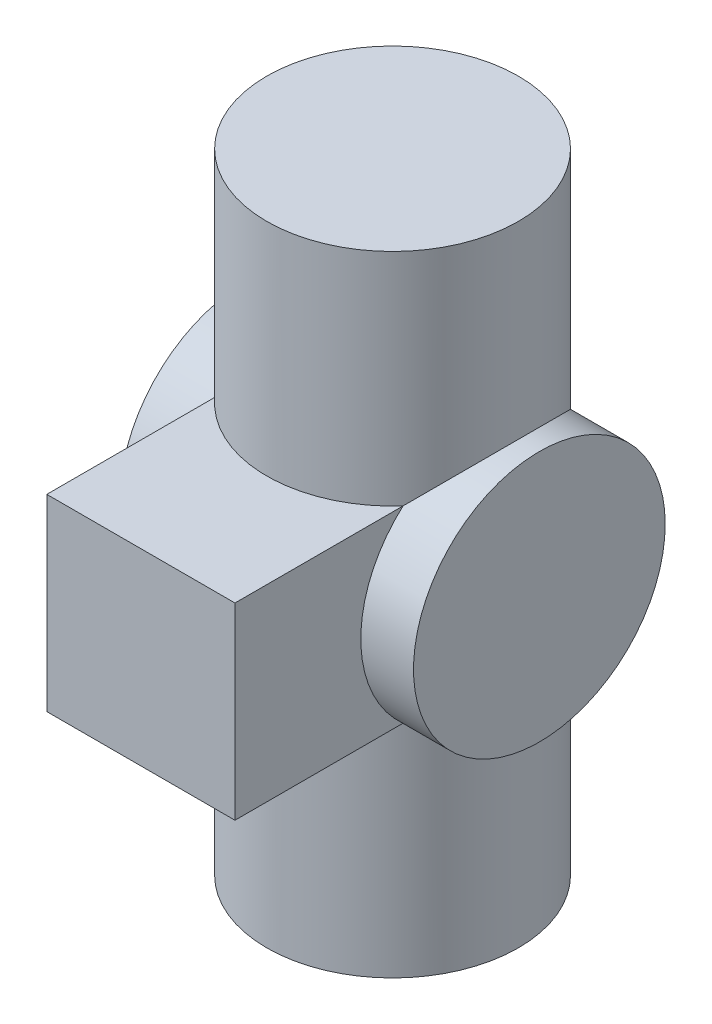
ISO-10303-21;
HEADER;
FILE_DESCRIPTION(('STEP AP214'),'2;1');
FILE_NAME('part.step','',(''),(''),'','','');
FILE_SCHEMA(('AUTOMOTIVE_DESIGN { 1 0 10303 214 1 1 1 1 }'));
ENDSEC;
DATA;
#1=APPLICATION_CONTEXT('core data for automotive mechanical design processes');
#2=APPLICATION_PROTOCOL_DEFINITION('international standard','automotive_design',2000,#1);
#3=PRODUCT_CONTEXT('',#1,'mechanical');
#4=PRODUCT('Part','Part','',(#3));
#5=PRODUCT_RELATED_PRODUCT_CATEGORY('part','',(#4));
#6=PRODUCT_DEFINITION_FORMATION('','',#4);
#7=PRODUCT_DEFINITION_CONTEXT('part definition',#1,'design');
#8=PRODUCT_DEFINITION('design','',#6,#7);
#9=PRODUCT_DEFINITION_SHAPE('','',#8);
#10=(LENGTH_UNIT() NAMED_UNIT(*) SI_UNIT(.MILLI.,.METRE.));
#11=(NAMED_UNIT(*) PLANE_ANGLE_UNIT() SI_UNIT($,.RADIAN.));
#12=(NAMED_UNIT(*) SI_UNIT($,.STERADIAN.) SOLID_ANGLE_UNIT());
#13=UNCERTAINTY_MEASURE_WITH_UNIT(LENGTH_MEASURE(1.E-05),#10,'distance_accuracy_value','');
#14=(GEOMETRIC_REPRESENTATION_CONTEXT(3) GLOBAL_UNCERTAINTY_ASSIGNED_CONTEXT((#13)) GLOBAL_UNIT_ASSIGNED_CONTEXT((#10,
#11,#12)) REPRESENTATION_CONTEXT('',''));
#15=CARTESIAN_POINT('',(0.,0.,0.));
#16=DIRECTION('',(0.,0.,1.));
#17=DIRECTION('',(1.,0.,0.));
#18=AXIS2_PLACEMENT_3D('',#15,#16,#17);
#19=CARTESIAN_POINT('',(0.,150.,0.));
#20=DIRECTION('',(0.,-1.,0.));
#21=DIRECTION('',(0.,0.,-1.));
#22=AXIS2_PLACEMENT_3D('',#19,#20,#21);
#23=CYLINDRICAL_SURFACE('',#22,30.);
#24=CARTESIAN_POINT('',(0.,150.,0.));
#25=DIRECTION('',(0.,1.,0.));
#26=DIRECTION('',(0.,0.,1.));
#27=AXIS2_PLACEMENT_3D('',#24,#25,#26);
#28=CIRCLE('',#27,30.);
#29=CARTESIAN_POINT('',(0.,150.,30.));
#30=VERTEX_POINT('',#29);
#31=EDGE_CURVE('E133',#30,#30,#28,.T.);
#32=ORIENTED_EDGE('',*,*,#31,.F.);
#33=EDGE_LOOP('',(#32));
#34=FACE_BOUND('',#33,.T.);
#35=CARTESIAN_POINT('',(0.,97.4302135046957,0.));
#36=DIRECTION('',(0.,-1.,0.));
#37=DIRECTION('',(0.,0.,-1.));
#38=AXIS2_PLACEMENT_3D('',#35,#36,#37);
#39=CIRCLE('',#38,30.);
#40=CARTESIAN_POINT('',(22.4302135046957,97.4302135046957,19.9219858983427));
#41=VERTEX_POINT('',#40);
#42=CARTESIAN_POINT('',(-22.4302135046957,97.4302135046957,19.9219858983427));
#43=VERTEX_POINT('',#42);
#44=EDGE_CURVE('E110',#41,#43,#39,.T.);
#45=ORIENTED_EDGE('',*,*,#44,.F.);
#46=CARTESIAN_POINT('',(0.,75.,0.));
#47=DIRECTION('',(0.707106781186547,-0.707106781186547,0.));
#48=DIRECTION('',(-0.707106781186547,-0.707106781186547,0.));
#49=AXIS2_PLACEMENT_3D('',#46,#47,#48);
#50=ELLIPSE('',#49,42.4264068711928,30.);
#51=CARTESIAN_POINT('',(0.,75.,-30.));
#52=VERTEX_POINT('',#51);
#53=EDGE_CURVE('E143',#52,#41,#50,.T.);
#54=ORIENTED_EDGE('',*,*,#53,.F.);
#55=CARTESIAN_POINT('',(0.,75.,0.));
#56=DIRECTION('',(-0.707106781186547,-0.707106781186547,0.));
#57=DIRECTION('',(0.707106781186547,-0.707106781186547,0.));
#58=AXIS2_PLACEMENT_3D('',#55,#56,#57);
#59=ELLIPSE('',#58,42.4264068711928,30.);
#60=EDGE_CURVE('E146',#43,#52,#59,.T.);
#61=ORIENTED_EDGE('',*,*,#60,.F.);
#62=EDGE_LOOP('',(#45,#54,#61));
#63=FACE_BOUND('',#62,.T.);
#64=ADVANCED_FACE('F39',(#34,#63),#23,.T.);
#65=CARTESIAN_POINT('',(35.,75.,0.));
#66=DIRECTION('',(-1.,0.,0.));
#67=DIRECTION('',(0.,0.,1.));
#68=AXIS2_PLACEMENT_3D('',#65,#66,#67);
#69=CYLINDRICAL_SURFACE('',#68,30.);
#70=CARTESIAN_POINT('',(-35.,75.,0.));
#71=DIRECTION('',(1.,0.,0.));
#72=DIRECTION('',(0.,0.,-1.));
#73=AXIS2_PLACEMENT_3D('',#70,#71,#72);
#74=CIRCLE('',#73,30.);
#75=CARTESIAN_POINT('',(-35.,75.,-30.));
#76=VERTEX_POINT('',#75);
#77=EDGE_CURVE('E124',#76,#76,#74,.T.);
#78=ORIENTED_EDGE('',*,*,#77,.T.);
#79=EDGE_LOOP('',(#78));
#80=FACE_BOUND('',#79,.T.);
#81=CARTESIAN_POINT('',(-22.4302135046957,75.,0.));
#82=DIRECTION('',(1.,0.,0.));
#83=DIRECTION('',(0.,0.,-1.));
#84=AXIS2_PLACEMENT_3D('',#81,#82,#83);
#85=CIRCLE('',#84,30.);
#86=CARTESIAN_POINT('',(-22.4302135046957,52.5697864953043,19.9219858983427));
#87=VERTEX_POINT('',#86);
#88=EDGE_CURVE('E54',#43,#87,#85,.T.);
#89=ORIENTED_EDGE('',*,*,#88,.F.);
#90=ORIENTED_EDGE('',*,*,#60,.T.);
#91=CARTESIAN_POINT('',(0.,75.,0.));
#92=DIRECTION('',(0.707106781186547,-0.707106781186547,0.));
#93=DIRECTION('',(-0.707106781186547,-0.707106781186547,0.));
#94=AXIS2_PLACEMENT_3D('',#91,#92,#93);
#95=ELLIPSE('',#94,42.4264068711928,30.);
#96=EDGE_CURVE('E137',#52,#87,#95,.F.);
#97=ORIENTED_EDGE('',*,*,#96,.T.);
#98=EDGE_LOOP('',(#89,#90,#97));
#99=FACE_BOUND('',#98,.T.);
#100=ADVANCED_FACE('F155',(#80,#99),#69,.T.);
#101=CARTESIAN_POINT('',(0.,0.,0.));
#102=DIRECTION('',(0.,1.,0.));
#103=DIRECTION('',(0.,0.,1.));
#104=AXIS2_PLACEMENT_3D('',#101,#102,#103);
#105=CIRCLE('',#104,30.);
#106=CARTESIAN_POINT('',(0.,0.,30.));
#107=VERTEX_POINT('',#106);
#108=EDGE_CURVE('E129',#107,#107,#105,.T.);
#109=ORIENTED_EDGE('',*,*,#108,.T.);
#110=EDGE_LOOP('',(#109));
#111=FACE_BOUND('',#110,.T.);
#112=CARTESIAN_POINT('',(0.,52.5697864953043,0.));
#113=DIRECTION('',(0.,1.,0.));
#114=DIRECTION('',(0.,0.,1.));
#115=AXIS2_PLACEMENT_3D('',#112,#113,#114);
#116=CIRCLE('',#115,30.);
#117=CARTESIAN_POINT('',(22.4302135046957,52.5697864953043,19.9219858983427));
#118=VERTEX_POINT('',#117);
#119=EDGE_CURVE('E62',#87,#118,#116,.T.);
#120=ORIENTED_EDGE('',*,*,#119,.F.);
#121=ORIENTED_EDGE('',*,*,#96,.F.);
#122=CARTESIAN_POINT('',(0.,75.,0.));
#123=DIRECTION('',(-0.707106781186547,-0.707106781186547,0.));
#124=DIRECTION('',(0.707106781186547,-0.707106781186547,0.));
#125=AXIS2_PLACEMENT_3D('',#122,#123,#124);
#126=ELLIPSE('',#125,42.4264068711928,30.);
#127=EDGE_CURVE('E47',#118,#52,#126,.F.);
#128=ORIENTED_EDGE('',*,*,#127,.F.);
#129=EDGE_LOOP('',(#120,#121,#128));
#130=FACE_BOUND('',#129,.T.);
#131=ADVANCED_FACE('F154',(#111,#130),#23,.T.);
#132=CARTESIAN_POINT('',(35.,75.,0.));
#133=DIRECTION('',(1.,0.,0.));
#134=DIRECTION('',(0.,0.,-1.));
#135=AXIS2_PLACEMENT_3D('',#132,#133,#134);
#136=CIRCLE('',#135,30.);
#137=CARTESIAN_POINT('',(35.,75.,-30.));
#138=VERTEX_POINT('',#137);
#139=EDGE_CURVE('E125',#138,#138,#136,.T.);
#140=ORIENTED_EDGE('',*,*,#139,.F.);
#141=EDGE_LOOP('',(#140));
#142=FACE_BOUND('',#141,.T.);
#143=CARTESIAN_POINT('',(22.4302135046957,75.,0.));
#144=DIRECTION('',(-1.,0.,0.));
#145=DIRECTION('',(0.,0.,1.));
#146=AXIS2_PLACEMENT_3D('',#143,#144,#145);
#147=CIRCLE('',#146,30.);
#148=EDGE_CURVE('E11',#118,#41,#147,.T.);
#149=ORIENTED_EDGE('',*,*,#148,.F.);
#150=ORIENTED_EDGE('',*,*,#127,.T.);
#151=ORIENTED_EDGE('',*,*,#53,.T.);
#152=EDGE_LOOP('',(#149,#150,#151));
#153=FACE_BOUND('',#152,.T.);
#154=ADVANCED_FACE('F152',(#142,#153),#69,.T.);
#155=CARTESIAN_POINT('',(0.,150.,0.));
#156=DIRECTION('',(0.,1.,0.));
#157=DIRECTION('',(0.,0.,1.));
#158=AXIS2_PLACEMENT_3D('',#155,#156,#157);
#159=PLANE('',#158);
#160=ORIENTED_EDGE('',*,*,#31,.T.);
#161=EDGE_LOOP('',(#160));
#162=FACE_BOUND('',#161,.T.);
#163=ADVANCED_FACE('F192',(#162),#159,.T.);
#164=CARTESIAN_POINT('',(-35.,75.,0.));
#165=DIRECTION('',(1.,0.,0.));
#166=DIRECTION('',(0.,0.,-1.));
#167=AXIS2_PLACEMENT_3D('',#164,#165,#166);
#168=PLANE('',#167);
#169=ORIENTED_EDGE('',*,*,#77,.F.);
#170=EDGE_LOOP('',(#169));
#171=FACE_BOUND('',#170,.T.);
#172=ADVANCED_FACE('F199',(#171),#168,.F.);
#173=CARTESIAN_POINT('',(0.,0.,0.));
#174=DIRECTION('',(0.,1.,0.));
#175=DIRECTION('',(0.,0.,1.));
#176=AXIS2_PLACEMENT_3D('',#173,#174,#175);
#177=PLANE('',#176);
#178=ORIENTED_EDGE('',*,*,#108,.F.);
#179=EDGE_LOOP('',(#178));
#180=FACE_BOUND('',#179,.T.);
#181=ADVANCED_FACE('F196',(#180),#177,.F.);
#182=CARTESIAN_POINT('',(35.,75.,0.));
#183=DIRECTION('',(1.,0.,0.));
#184=DIRECTION('',(0.,0.,-1.));
#185=AXIS2_PLACEMENT_3D('',#182,#183,#184);
#186=PLANE('',#185);
#187=ORIENTED_EDGE('',*,*,#139,.T.);
#188=EDGE_LOOP('',(#187));
#189=FACE_BOUND('',#188,.T.);
#190=ADVANCED_FACE('F198',(#189),#186,.T.);
#191=CARTESIAN_POINT('',(-22.4302135046957,52.5697864953043,60.));
#192=DIRECTION('',(1.,0.,0.));
#193=DIRECTION('',(0.,0.,-1.));
#194=AXIS2_PLACEMENT_3D('',#191,#192,#193);
#195=PLANE('',#194);
#196=DIRECTION('',(0.,0.,-1.));
#197=VECTOR('',#196,1.);
#198=CARTESIAN_POINT('',(-22.4302135046957,97.4302135046957,60.));
#199=LINE('',#198,#197);
#200=CARTESIAN_POINT('',(-22.4302135046957,97.4302135046957,60.));
#201=VERTEX_POINT('',#200);
#202=EDGE_CURVE('E89',#201,#43,#199,.T.);
#203=ORIENTED_EDGE('',*,*,#202,.T.);
#204=ORIENTED_EDGE('',*,*,#88,.T.);
#205=DIRECTION('',(0.,0.,-1.));
#206=VECTOR('',#205,1.);
#207=CARTESIAN_POINT('',(-22.4302135046957,52.5697864953043,60.));
#208=LINE('',#207,#206);
#209=CARTESIAN_POINT('',(-22.4302135046957,52.5697864953043,60.));
#210=VERTEX_POINT('',#209);
#211=EDGE_CURVE('E91',#210,#87,#208,.T.);
#212=ORIENTED_EDGE('',*,*,#211,.F.);
#213=DIRECTION('',(0.,-1.,0.));
#214=VECTOR('',#213,1.);
#215=CARTESIAN_POINT('',(-22.4302135046957,52.5697864953043,60.));
#216=LINE('',#215,#214);
#217=EDGE_CURVE('E85',#201,#210,#216,.T.);
#218=ORIENTED_EDGE('',*,*,#217,.F.);
#219=EDGE_LOOP('',(#203,#204,#212,#218));
#220=FACE_BOUND('',#219,.T.);
#221=ADVANCED_FACE('F87',(#220),#195,.F.);
#222=CARTESIAN_POINT('',(22.4302135046957,52.5697864953043,60.));
#223=DIRECTION('',(0.,1.,0.));
#224=DIRECTION('',(0.,0.,1.));
#225=AXIS2_PLACEMENT_3D('',#222,#223,#224);
#226=PLANE('',#225);
#227=ORIENTED_EDGE('',*,*,#211,.T.);
#228=ORIENTED_EDGE('',*,*,#119,.T.);
#229=DIRECTION('',(0.,0.,-1.));
#230=VECTOR('',#229,1.);
#231=CARTESIAN_POINT('',(22.4302135046957,52.5697864953043,60.));
#232=LINE('',#231,#230);
#233=CARTESIAN_POINT('',(22.4302135046957,52.5697864953043,60.));
#234=VERTEX_POINT('',#233);
#235=EDGE_CURVE('E116',#234,#118,#232,.T.);
#236=ORIENTED_EDGE('',*,*,#235,.F.);
#237=DIRECTION('',(1.,0.,0.));
#238=VECTOR('',#237,1.);
#239=CARTESIAN_POINT('',(22.4302135046957,52.5697864953043,60.));
#240=LINE('',#239,#238);
#241=EDGE_CURVE('E95',#210,#234,#240,.T.);
#242=ORIENTED_EDGE('',*,*,#241,.F.);
#243=EDGE_LOOP('',(#227,#228,#236,#242));
#244=FACE_BOUND('',#243,.T.);
#245=ADVANCED_FACE('F157',(#244),#226,.F.);
#246=CARTESIAN_POINT('',(0.,97.4302135046957,60.));
#247=DIRECTION('',(0.,-1.,0.));
#248=DIRECTION('',(0.,0.,-1.));
#249=AXIS2_PLACEMENT_3D('',#246,#247,#248);
#250=PLANE('',#249);
#251=DIRECTION('',(0.,0.,-1.));
#252=VECTOR('',#251,1.);
#253=CARTESIAN_POINT('',(22.4302135046957,97.4302135046957,60.));
#254=LINE('',#253,#252);
#255=CARTESIAN_POINT('',(22.4302135046957,97.4302135046957,60.));
#256=VERTEX_POINT('',#255);
#257=EDGE_CURVE('E163',#256,#41,#254,.T.);
#258=ORIENTED_EDGE('',*,*,#257,.T.);
#259=ORIENTED_EDGE('',*,*,#44,.T.);
#260=ORIENTED_EDGE('',*,*,#202,.F.);
#261=DIRECTION('',(-1.,0.,0.));
#262=VECTOR('',#261,1.);
#263=CARTESIAN_POINT('',(-22.4302135046957,97.4302135046957,60.));
#264=LINE('',#263,#262);
#265=EDGE_CURVE('E96',#256,#201,#264,.T.);
#266=ORIENTED_EDGE('',*,*,#265,.F.);
#267=EDGE_LOOP('',(#258,#259,#260,#266));
#268=FACE_BOUND('',#267,.T.);
#269=ADVANCED_FACE('F108',(#268),#250,.F.);
#270=CARTESIAN_POINT('',(22.4302135046957,97.4302135046957,60.));
#271=DIRECTION('',(-1.,0.,0.));
#272=DIRECTION('',(0.,0.,1.));
#273=AXIS2_PLACEMENT_3D('',#270,#271,#272);
#274=PLANE('',#273);
#275=ORIENTED_EDGE('',*,*,#235,.T.);
#276=ORIENTED_EDGE('',*,*,#148,.T.);
#277=ORIENTED_EDGE('',*,*,#257,.F.);
#278=DIRECTION('',(0.,1.,0.));
#279=VECTOR('',#278,1.);
#280=CARTESIAN_POINT('',(22.4302135046957,97.4302135046957,60.));
#281=LINE('',#280,#279);
#282=EDGE_CURVE('E101',#234,#256,#281,.T.);
#283=ORIENTED_EDGE('',*,*,#282,.F.);
#284=EDGE_LOOP('',(#275,#276,#277,#283));
#285=FACE_BOUND('',#284,.T.);
#286=ADVANCED_FACE('F169',(#285),#274,.F.);
#287=CARTESIAN_POINT('',(0.,0.,60.));
#288=DIRECTION('',(0.,0.,-1.));
#289=DIRECTION('',(-1.,0.,0.));
#290=AXIS2_PLACEMENT_3D('',#287,#288,#289);
#291=PLANE('',#290);
#292=ORIENTED_EDGE('',*,*,#265,.T.);
#293=ORIENTED_EDGE('',*,*,#217,.T.);
#294=ORIENTED_EDGE('',*,*,#241,.T.);
#295=ORIENTED_EDGE('',*,*,#282,.T.);
#296=EDGE_LOOP('',(#292,#293,#294,#295));
#297=FACE_BOUND('',#296,.T.);
#298=ADVANCED_FACE('F99',(#297),#291,.F.);
#299=CLOSED_SHELL('',(#64,#100,#131,#154,#163,#172,#181,#190,#221,#245,#269,#286,#298));
#300=MANIFOLD_SOLID_BREP('B2',#299);
#301=ADVANCED_BREP_SHAPE_REPRESENTATION('',(#18,#300),#14);
#302=SHAPE_DEFINITION_REPRESENTATION(#9,#301);
ENDSEC;
END-ISO-10303-21;
